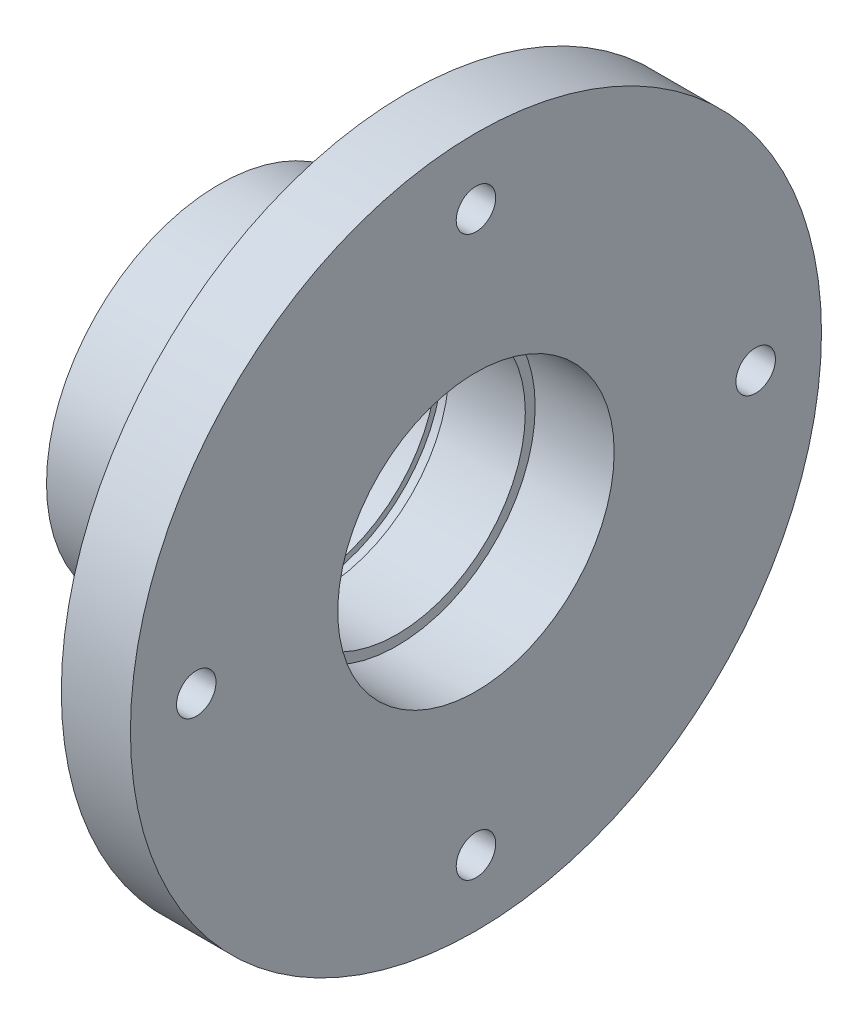
ISO-10303-21;
HEADER;
FILE_DESCRIPTION(('STEP AP214'),'2;1');
FILE_NAME('part.step','',(''),(''),'','','');
FILE_SCHEMA(('AUTOMOTIVE_DESIGN { 1 0 10303 214 1 1 1 1 }'));
ENDSEC;
DATA;
#1=APPLICATION_CONTEXT('core data for automotive mechanical design processes');
#2=APPLICATION_PROTOCOL_DEFINITION('international standard','automotive_design',2000,#1);
#3=PRODUCT_CONTEXT('',#1,'mechanical');
#4=PRODUCT('Part','Part','',(#3));
#5=PRODUCT_RELATED_PRODUCT_CATEGORY('part','',(#4));
#6=PRODUCT_DEFINITION_FORMATION('','',#4);
#7=PRODUCT_DEFINITION_CONTEXT('part definition',#1,'design');
#8=PRODUCT_DEFINITION('design','',#6,#7);
#9=PRODUCT_DEFINITION_SHAPE('','',#8);
#10=(LENGTH_UNIT() NAMED_UNIT(*) SI_UNIT(.MILLI.,.METRE.));
#11=(NAMED_UNIT(*) PLANE_ANGLE_UNIT() SI_UNIT($,.RADIAN.));
#12=(NAMED_UNIT(*) SI_UNIT($,.STERADIAN.) SOLID_ANGLE_UNIT());
#13=UNCERTAINTY_MEASURE_WITH_UNIT(LENGTH_MEASURE(1.E-05),#10,'distance_accuracy_value','');
#14=(GEOMETRIC_REPRESENTATION_CONTEXT(3) GLOBAL_UNCERTAINTY_ASSIGNED_CONTEXT((#13)) GLOBAL_UNIT_ASSIGNED_CONTEXT((#10,
#11,#12)) REPRESENTATION_CONTEXT('',''));
#15=CARTESIAN_POINT('',(0.,0.,0.));
#16=DIRECTION('',(0.,0.,1.));
#17=DIRECTION('',(1.,0.,0.));
#18=AXIS2_PLACEMENT_3D('',#15,#16,#17);
#19=CARTESIAN_POINT('',(-22.,0.,0.));
#20=DIRECTION('',(1.,0.,0.));
#21=DIRECTION('',(0.,0.,-1.));
#22=AXIS2_PLACEMENT_3D('',#19,#20,#21);
#23=CYLINDRICAL_SURFACE('',#22,13.);
#24=CARTESIAN_POINT('',(-22.,0.,0.));
#25=DIRECTION('',(1.,0.,0.));
#26=DIRECTION('',(0.,0.,-1.));
#27=AXIS2_PLACEMENT_3D('',#24,#25,#26);
#28=CIRCLE('',#27,13.);
#29=CARTESIAN_POINT('',(-22.,0.,-13.));
#30=VERTEX_POINT('',#29);
#31=EDGE_CURVE('E65',#30,#30,#28,.T.);
#32=ORIENTED_EDGE('',*,*,#31,.F.);
#33=EDGE_LOOP('',(#32));
#34=FACE_BOUND('',#33,.T.);
#35=CARTESIAN_POINT('',(-16.975,0.,0.));
#36=DIRECTION('',(1.,0.,0.));
#37=DIRECTION('',(0.,0.,-1.));
#38=AXIS2_PLACEMENT_3D('',#35,#36,#37);
#39=CIRCLE('',#38,13.);
#40=CARTESIAN_POINT('',(-16.975,0.,-13.));
#41=VERTEX_POINT('',#40);
#42=EDGE_CURVE('E34',#41,#41,#39,.F.);
#43=ORIENTED_EDGE('',*,*,#42,.F.);
#44=EDGE_LOOP('',(#43));
#45=FACE_BOUND('',#44,.T.);
#46=ADVANCED_FACE('F30',(#34,#45),#23,.F.);
#47=CARTESIAN_POINT('',(-15.725,0.,0.));
#48=DIRECTION('',(1.,0.,0.));
#49=DIRECTION('',(0.,0.,-1.));
#50=AXIS2_PLACEMENT_3D('',#47,#48,#49);
#51=CIRCLE('',#50,13.);
#52=CARTESIAN_POINT('',(-15.725,0.,-13.));
#53=VERTEX_POINT('',#52);
#54=EDGE_CURVE('E70',#53,#53,#51,.F.);
#55=ORIENTED_EDGE('',*,*,#54,.T.);
#56=EDGE_LOOP('',(#55));
#57=FACE_BOUND('',#56,.T.);
#58=CARTESIAN_POINT('',(-11.,12.7573508221731,2.5));
#59=CARTESIAN_POINT('',(-11.1390258597614,12.7573535445971,2.49999473771111));
#60=CARTESIAN_POINT('',(-11.2781192301831,12.759648106677,2.48836372459743));
#61=CARTESIAN_POINT('',(-11.5523790588853,12.7685662321878,2.44218113719486));
#62=CARTESIAN_POINT('',(-11.6875421600585,12.7751933891363,2.40761053611891));
#63=CARTESIAN_POINT('',(-11.9499336447423,12.7919990068767,2.31665374663639));
#64=CARTESIAN_POINT('',(-12.0771694738245,12.8021740742201,2.26028839852833));
#65=CARTESIAN_POINT('',(-12.3203725499391,12.8249250156472,2.12739803553043));
#66=CARTESIAN_POINT('',(-12.4363405806682,12.8375007225812,2.05087442406184));
#67=CARTESIAN_POINT('',(-12.6552412124363,12.8638197867113,1.87877245822431));
#68=CARTESIAN_POINT('',(-12.7580049495083,12.8775751102276,1.78298111863696));
#69=CARTESIAN_POINT('',(-12.9461075301476,12.90459798027,1.5755231225806));
#70=CARTESIAN_POINT('',(-13.0314452009445,12.9178654939172,1.46385539849171));
#71=CARTESIAN_POINT('',(-13.1829234102577,12.9425463769484,1.22670187107625));
#72=CARTESIAN_POINT('',(-13.248904258705,12.9539439985905,1.10111228887017));
#73=CARTESIAN_POINT('',(-13.3587664253272,12.9734667695503,0.840374478610753));
#74=CARTESIAN_POINT('',(-13.4026496551198,12.9815922019259,0.705227078537796));
#75=CARTESIAN_POINT('',(-13.4665474035056,12.9935705508999,0.430960845173449));
#76=CARTESIAN_POINT('',(-13.4868467751201,12.9974744160998,0.291910638125103));
#77=CARTESIAN_POINT('',(-13.5038885832221,13.0007455117712,0.0123270709409626));
#78=CARTESIAN_POINT('',(-13.500633125336,13.000113147748,-0.128206155502509));
#79=CARTESIAN_POINT('',(-13.4708752373941,12.9944227232998,-0.404811580289859));
#80=CARTESIAN_POINT('',(-13.4446795668691,12.9894230651197,-0.540918156089658));
#81=CARTESIAN_POINT('',(-13.3702705456875,12.9756254537905,-0.806767049653698));
#82=CARTESIAN_POINT('',(-13.3220563622883,12.9668273569848,-0.936509126506344));
#83=CARTESIAN_POINT('',(-13.2046897178559,12.9463243258099,-1.18683036724386));
#84=CARTESIAN_POINT('',(-13.135415554715,12.9346025687447,-1.30735103519341));
#85=CARTESIAN_POINT('',(-12.9779852060605,12.9095469786329,-1.53517146817959));
#86=CARTESIAN_POINT('',(-12.8898270046743,12.8962129735448,-1.64246981980512));
#87=CARTESIAN_POINT('',(-12.6954434908314,12.8691545349335,-1.84261846944045));
#88=CARTESIAN_POINT('',(-12.588949765765,12.855427272809,-1.93520788986346));
#89=CARTESIAN_POINT('',(-12.3618098253276,12.8293343997587,-2.10125316353158));
#90=CARTESIAN_POINT('',(-12.2411633810472,12.8169688108631,-2.17470870723888));
#91=CARTESIAN_POINT('',(-11.9887859827288,12.7949946866484,-2.30048133251873));
#92=CARTESIAN_POINT('',(-11.8570348448764,12.785391318016,-2.35275887460557));
#93=CARTESIAN_POINT('',(-11.5863924456211,12.7701067672006,-2.43436110074129));
#94=CARTESIAN_POINT('',(-11.4475020409036,12.7644251156011,-2.4636885318979));
#95=CARTESIAN_POINT('',(-11.1688806753715,12.7577206137951,-2.49817375220936));
#96=CARTESIAN_POINT('',(-11.0291978863162,12.7566253860666,-2.50370706985663));
#97=CARTESIAN_POINT('',(-10.7509046361303,12.759023830842,-2.49145509963841));
#98=CARTESIAN_POINT('',(-10.6122941194314,12.7625172639236,-2.4736710284025));
#99=CARTESIAN_POINT('',(-10.3413250568075,12.7736318530023,-2.41561200598846));
#100=CARTESIAN_POINT('',(-10.2089223958334,12.7812165991315,-2.37553534674613));
#101=CARTESIAN_POINT('',(-9.95271115254549,12.7996276252393,-2.27423978654129));
#102=CARTESIAN_POINT('',(-9.82890323296415,12.8104541548475,-2.21301925736502));
#103=CARTESIAN_POINT('',(-9.59174575761499,12.8342928537119,-2.07031485911768));
#104=CARTESIAN_POINT('',(-9.47854098556228,12.8473298999345,-1.98859461228271));
#105=CARTESIAN_POINT('',(-9.26731488113404,12.8740513624295,-1.80752787788233));
#106=CARTESIAN_POINT('',(-9.16929498985282,12.8877358399847,-1.70817971928818));
#107=CARTESIAN_POINT('',(-8.98981024796654,12.9144437282901,-1.49299681253014));
#108=CARTESIAN_POINT('',(-8.90859846794263,12.9274550888692,-1.37694924353664));
#109=CARTESIAN_POINT('',(-8.76682469390508,12.951145430407,-1.13263940226607));
#110=CARTESIAN_POINT('',(-8.70626187660335,12.9618245043496,-1.00437761723896));
#111=CARTESIAN_POINT('',(-8.60788027016444,12.9795953468859,-0.739966613700504));
#112=CARTESIAN_POINT('',(-8.56993918935383,12.9867063704086,-0.603864248412594));
#113=CARTESIAN_POINT('',(-8.5174888053798,12.9966222021743,-0.327068775042134));
#114=CARTESIAN_POINT('',(-8.50297690260318,12.9994274881639,-0.186376178041926));
#115=CARTESIAN_POINT('',(-8.49789116850745,13.0004055871504,0.0931827521181667));
#116=CARTESIAN_POINT('',(-8.5069357776698,12.9986522399737,0.232042028620335));
#117=CARTESIAN_POINT('',(-8.54786808016568,12.9908642019523,0.506222907249127));
#118=CARTESIAN_POINT('',(-8.5797555295344,12.9848295568325,0.641544547142218));
#119=CARTESIAN_POINT('',(-8.66530419238812,12.9691577474469,0.9045935492543));
#120=CARTESIAN_POINT('',(-8.71892280835151,12.9595276339264,1.03233521137864));
#121=CARTESIAN_POINT('',(-8.84636511450712,12.9377052532993,1.27706488245869));
#122=CARTESIAN_POINT('',(-8.92019025157382,12.9255128027329,1.39405212054941));
#123=CARTESIAN_POINT('',(-9.08725345032979,12.8996784805017,1.61584795767645));
#124=CARTESIAN_POINT('',(-9.18076617207764,12.8860176059801,1.72044748489624));
#125=CARTESIAN_POINT('',(-9.38398218256116,12.8589033276349,1.91260166612257));
#126=CARTESIAN_POINT('',(-9.4936892826799,12.8454499734772,2.00015229635294));
#127=CARTESIAN_POINT('',(-9.72746983895478,12.8201292259648,2.15653452422156));
#128=CARTESIAN_POINT('',(-9.85167375891601,12.8082786988589,2.22517391596926));
#129=CARTESIAN_POINT('',(-10.1100407737514,12.7877094152025,2.340501544276));
#130=CARTESIAN_POINT('',(-10.2441944703403,12.7789877475578,2.3872101977801));
#131=CARTESIAN_POINT('',(-10.4822583747453,12.7674530961672,2.4480213622143));
#132=CARTESIAN_POINT('',(-10.5847879876044,12.7636876084207,2.46747939479382));
#133=CARTESIAN_POINT('',(-10.7915324463374,12.7586354876446,2.49347049397996));
#134=CARTESIAN_POINT('',(-10.8957472418541,12.7573487806808,2.50000394608695));
#135=CARTESIAN_POINT('',(-11.,12.7573508221731,2.5));
#136=B_SPLINE_CURVE_WITH_KNOTS('',3,(#58,#59,#60,#61,#62,#63,#64,#65,#66,#67,#68,#69,#70,#71,
#72,#73,#74,#75,#76,#77,#78,#79,#80,#81,#82,#83,#84,#85,#86,#87,#88,#89,#90,#91,#92,#93,#94,#95,
#96,#97,#98,#99,#100,#101,#102,#103,#104,#105,#106,#107,#108,#109,#110,#111,#112,#113,#114,#115,
#116,#117,#118,#119,#120,#121,#122,#123,#124,#125,#126,#127,#128,#129,#130,#131,#132,#133,#134,
#135),.UNSPECIFIED.,.T.,.F.,(4,2,2,2,2,2,2,2,2,2,2,2,2,2,2,2,2,2,2,2,2,2,2,2,2,2,2,2,2,2,2,2,2,
2,2,2,2,2,4),(0.,0.416695988880008,0.833738030737637,1.25038227614466,1.66699752238094,
2.08849971831381,2.5100302719089,2.93494642182602,3.35982580683554,3.77951819081206,
4.19917305788035,4.61330049028081,5.02744358632398,5.44402696725573,5.8606548406758,
6.28400091938148,6.70735384633274,7.13149357344847,7.55558252364952,7.97295317898353,
8.39030205806814,8.8039966609312,9.21772312804067,9.63645909210582,10.0552347712562,
10.4799185943274,10.9045854829869,11.32693532976,11.7492383109661,12.1647436860035,
12.5802446234502,12.9949350033565,13.4096550846627,13.8305978202814,14.251639784134,
14.6768151908599,15.1015939816585,15.4140754294552,15.7265475567531),.UNSPECIFIED.);
#137=CARTESIAN_POINT('',(-11.,12.7573508221731,2.5));
#138=VERTEX_POINT('',#137);
#139=EDGE_CURVE('E68',#138,#138,#136,.T.);
#140=ORIENTED_EDGE('',*,*,#139,.F.);
#141=EDGE_LOOP('',(#140));
#142=FACE_BOUND('',#141,.T.);
#143=CARTESIAN_POINT('',(-8.,0.,0.));
#144=DIRECTION('',(1.,0.,0.));
#145=DIRECTION('',(0.,0.,-1.));
#146=AXIS2_PLACEMENT_3D('',#143,#144,#145);
#147=CIRCLE('',#146,13.);
#148=CARTESIAN_POINT('',(-8.,0.,-13.));
#149=VERTEX_POINT('',#148);
#150=EDGE_CURVE('E66',#149,#149,#147,.F.);
#151=ORIENTED_EDGE('',*,*,#150,.F.);
#152=EDGE_LOOP('',(#151));
#153=FACE_BOUND('',#152,.T.);
#154=ADVANCED_FACE('F128',(#57,#142,#153),#23,.F.);
#155=CARTESIAN_POINT('',(0.001000000000001,0.,0.));
#156=DIRECTION('',(-1.,0.,0.));
#157=DIRECTION('',(0.,0.,1.));
#158=AXIS2_PLACEMENT_3D('',#155,#156,#157);
#159=CYLINDRICAL_SURFACE('',#158,9.5);
#160=CARTESIAN_POINT('',(-26.,0.,0.));
#161=DIRECTION('',(-1.,0.,0.));
#162=DIRECTION('',(0.,0.,1.));
#163=AXIS2_PLACEMENT_3D('',#160,#161,#162);
#164=CIRCLE('',#163,9.5);
#165=CARTESIAN_POINT('',(-26.,0.,9.5));
#166=VERTEX_POINT('',#165);
#167=EDGE_CURVE('E64',#166,#166,#164,.T.);
#168=ORIENTED_EDGE('',*,*,#167,.T.);
#169=EDGE_LOOP('',(#168));
#170=FACE_BOUND('',#169,.T.);
#171=CARTESIAN_POINT('',(-22.,0.,0.));
#172=DIRECTION('',(1.,0.,0.));
#173=DIRECTION('',(0.,0.,-1.));
#174=AXIS2_PLACEMENT_3D('',#171,#172,#173);
#175=CIRCLE('',#174,9.5);
#176=CARTESIAN_POINT('',(-22.,0.,-9.5));
#177=VERTEX_POINT('',#176);
#178=EDGE_CURVE('E61',#177,#177,#175,.F.);
#179=ORIENTED_EDGE('',*,*,#178,.F.);
#180=EDGE_LOOP('',(#179));
#181=FACE_BOUND('',#180,.T.);
#182=ADVANCED_FACE('F134',(#170,#181),#159,.F.);
#183=CARTESIAN_POINT('',(11.,-8.05187028163345E-13,-28.3299999999992));
#184=DIRECTION('',(-1.,0.,0.));
#185=DIRECTION('',(0.,0.,1.));
#186=AXIS2_PLACEMENT_3D('',#183,#184,#185);
#187=CYLINDRICAL_SURFACE('',#186,2.00000000000129);
#188=CARTESIAN_POINT('',(0.,-8.05187028163345E-13,-28.3299999999992));
#189=DIRECTION('',(1.,0.,0.));
#190=DIRECTION('',(0.,0.,-1.));
#191=AXIS2_PLACEMENT_3D('',#188,#189,#190);
#192=CIRCLE('',#191,2.00000000000129);
#193=CARTESIAN_POINT('',(0.,-8.05187028163345E-13,-30.3300000000005));
#194=VERTEX_POINT('',#193);
#195=EDGE_CURVE('E60',#194,#194,#192,.T.);
#196=ORIENTED_EDGE('',*,*,#195,.T.);
#197=EDGE_LOOP('',(#196));
#198=FACE_BOUND('',#197,.T.);
#199=CARTESIAN_POINT('',(-4.,-8.05187028163345E-13,-28.3299999999992));
#200=DIRECTION('',(-1.,0.,0.));
#201=DIRECTION('',(0.,0.,1.));
#202=AXIS2_PLACEMENT_3D('',#199,#200,#201);
#203=CIRCLE('',#202,2.00000000000129);
#204=CARTESIAN_POINT('',(-4.,-8.05187028163345E-13,-26.3299999999979));
#205=VERTEX_POINT('',#204);
#206=EDGE_CURVE('E57',#205,#205,#203,.F.);
#207=ORIENTED_EDGE('',*,*,#206,.F.);
#208=EDGE_LOOP('',(#207));
#209=FACE_BOUND('',#208,.T.);
#210=ADVANCED_FACE('F142',(#198,#209),#187,.F.);
#211=CARTESIAN_POINT('',(11.,-28.33,1.60343520756272E-12));
#212=DIRECTION('',(-1.,0.,0.));
#213=DIRECTION('',(0.,0.,1.));
#214=AXIS2_PLACEMENT_3D('',#211,#212,#213);
#215=CYLINDRICAL_SURFACE('',#214,2.00000000000172);
#216=CARTESIAN_POINT('',(0.,-28.33,1.60343520756272E-12));
#217=DIRECTION('',(1.,0.,0.));
#218=DIRECTION('',(0.,0.,-1.));
#219=AXIS2_PLACEMENT_3D('',#216,#217,#218);
#220=CIRCLE('',#219,2.00000000000172);
#221=CARTESIAN_POINT('',(0.,-28.33,-2.00000000000012));
#222=VERTEX_POINT('',#221);
#223=EDGE_CURVE('E222',#222,#222,#220,.T.);
#224=ORIENTED_EDGE('',*,*,#223,.T.);
#225=EDGE_LOOP('',(#224));
#226=FACE_BOUND('',#225,.T.);
#227=CARTESIAN_POINT('',(-4.,-28.33,1.60343520756272E-12));
#228=DIRECTION('',(-1.,0.,0.));
#229=DIRECTION('',(0.,0.,1.));
#230=AXIS2_PLACEMENT_3D('',#227,#228,#229);
#231=CIRCLE('',#230,2.00000000000172);
#232=CARTESIAN_POINT('',(-4.,-28.33,2.00000000000333));
#233=VERTEX_POINT('',#232);
#234=EDGE_CURVE('E54',#233,#233,#231,.F.);
#235=ORIENTED_EDGE('',*,*,#234,.F.);
#236=EDGE_LOOP('',(#235));
#237=FACE_BOUND('',#236,.T.);
#238=ADVANCED_FACE('F184',(#226,#237),#215,.F.);
#239=CARTESIAN_POINT('',(11.,8.01717603781361E-13,28.3300000000008));
#240=DIRECTION('',(-1.,0.,0.));
#241=DIRECTION('',(0.,0.,1.));
#242=AXIS2_PLACEMENT_3D('',#239,#240,#241);
#243=CYLINDRICAL_SURFACE('',#242,2.00000000000063);
#244=CARTESIAN_POINT('',(0.,8.01717603781361E-13,28.3300000000008));
#245=DIRECTION('',(1.,0.,0.));
#246=DIRECTION('',(0.,0.,-1.));
#247=AXIS2_PLACEMENT_3D('',#244,#245,#246);
#248=CIRCLE('',#247,2.00000000000063);
#249=CARTESIAN_POINT('',(0.,8.01717603781361E-13,26.3300000000002));
#250=VERTEX_POINT('',#249);
#251=EDGE_CURVE('E218',#250,#250,#248,.T.);
#252=ORIENTED_EDGE('',*,*,#251,.T.);
#253=EDGE_LOOP('',(#252));
#254=FACE_BOUND('',#253,.T.);
#255=CARTESIAN_POINT('',(-4.,8.01717603781361E-13,28.3300000000008));
#256=DIRECTION('',(-1.,0.,0.));
#257=DIRECTION('',(0.,0.,1.));
#258=AXIS2_PLACEMENT_3D('',#255,#256,#257);
#259=CIRCLE('',#258,2.00000000000063);
#260=CARTESIAN_POINT('',(-4.,8.01717603781361E-13,30.3300000000014));
#261=VERTEX_POINT('',#260);
#262=EDGE_CURVE('E50',#261,#261,#259,.F.);
#263=ORIENTED_EDGE('',*,*,#262,.F.);
#264=EDGE_LOOP('',(#263));
#265=FACE_BOUND('',#264,.T.);
#266=ADVANCED_FACE('F180',(#254,#265),#243,.F.);
#267=CARTESIAN_POINT('',(11.,28.33,0.));
#268=DIRECTION('',(-1.,0.,0.));
#269=DIRECTION('',(0.,0.,1.));
#270=AXIS2_PLACEMENT_3D('',#267,#268,#269);
#271=CYLINDRICAL_SURFACE('',#270,2.);
#272=CARTESIAN_POINT('',(0.,28.33,0.));
#273=DIRECTION('',(1.,0.,0.));
#274=DIRECTION('',(0.,0.,-1.));
#275=AXIS2_PLACEMENT_3D('',#272,#273,#274);
#276=CIRCLE('',#275,2.);
#277=CARTESIAN_POINT('',(0.,28.33,-2.));
#278=VERTEX_POINT('',#277);
#279=EDGE_CURVE('E214',#278,#278,#276,.T.);
#280=ORIENTED_EDGE('',*,*,#279,.T.);
#281=EDGE_LOOP('',(#280));
#282=FACE_BOUND('',#281,.T.);
#283=CARTESIAN_POINT('',(-4.,28.33,0.));
#284=DIRECTION('',(-1.,0.,0.));
#285=DIRECTION('',(0.,0.,1.));
#286=AXIS2_PLACEMENT_3D('',#283,#284,#285);
#287=CIRCLE('',#286,2.);
#288=CARTESIAN_POINT('',(-4.,28.33,2.));
#289=VERTEX_POINT('',#288);
#290=EDGE_CURVE('E47',#289,#289,#287,.F.);
#291=ORIENTED_EDGE('',*,*,#290,.F.);
#292=EDGE_LOOP('',(#291));
#293=FACE_BOUND('',#292,.T.);
#294=ADVANCED_FACE('F177',(#282,#293),#271,.F.);
#295=CARTESIAN_POINT('',(-26.,0.,0.));
#296=DIRECTION('',(1.,0.,0.));
#297=DIRECTION('',(0.,0.,-1.));
#298=AXIS2_PLACEMENT_3D('',#295,#296,#297);
#299=CYLINDRICAL_SURFACE('',#298,35.);
#300=CARTESIAN_POINT('',(0.,0.,0.));
#301=DIRECTION('',(1.,0.,0.));
#302=DIRECTION('',(0.,0.,-1.));
#303=AXIS2_PLACEMENT_3D('',#300,#301,#302);
#304=CIRCLE('',#303,35.);
#305=CARTESIAN_POINT('',(0.,0.,-35.));
#306=VERTEX_POINT('',#305);
#307=EDGE_CURVE('E10',#306,#306,#304,.T.);
#308=ORIENTED_EDGE('',*,*,#307,.F.);
#309=EDGE_LOOP('',(#308));
#310=FACE_BOUND('',#309,.T.);
#311=CARTESIAN_POINT('',(-7.,0.,0.));
#312=DIRECTION('',(-1.,0.,0.));
#313=DIRECTION('',(0.,0.,1.));
#314=AXIS2_PLACEMENT_3D('',#311,#312,#313);
#315=CIRCLE('',#314,35.);
#316=CARTESIAN_POINT('',(-7.,0.,35.));
#317=VERTEX_POINT('',#316);
#318=EDGE_CURVE('E38',#317,#317,#315,.T.);
#319=ORIENTED_EDGE('',*,*,#318,.F.);
#320=EDGE_LOOP('',(#319));
#321=FACE_BOUND('',#320,.T.);
#322=ADVANCED_FACE('F32',(#310,#321),#299,.T.);
#323=CARTESIAN_POINT('',(0.,0.,0.));
#324=DIRECTION('',(1.,0.,0.));
#325=DIRECTION('',(0.,0.,-1.));
#326=AXIS2_PLACEMENT_3D('',#323,#324,#325);
#327=PLANE('',#326);
#328=CARTESIAN_POINT('',(0.,0.,0.));
#329=DIRECTION('',(1.,0.,0.));
#330=DIRECTION('',(0.,0.,-1.));
#331=AXIS2_PLACEMENT_3D('',#328,#329,#330);
#332=CIRCLE('',#331,14.);
#333=CARTESIAN_POINT('',(0.,0.,-14.));
#334=VERTEX_POINT('',#333);
#335=EDGE_CURVE('E76',#334,#334,#332,.T.);
#336=ORIENTED_EDGE('',*,*,#335,.F.);
#337=EDGE_LOOP('',(#336));
#338=FACE_BOUND('',#337,.T.);
#339=ORIENTED_EDGE('',*,*,#279,.F.);
#340=EDGE_LOOP('',(#339));
#341=FACE_BOUND('',#340,.T.);
#342=ORIENTED_EDGE('',*,*,#251,.F.);
#343=EDGE_LOOP('',(#342));
#344=FACE_BOUND('',#343,.T.);
#345=ORIENTED_EDGE('',*,*,#223,.F.);
#346=EDGE_LOOP('',(#345));
#347=FACE_BOUND('',#346,.T.);
#348=ORIENTED_EDGE('',*,*,#195,.F.);
#349=EDGE_LOOP('',(#348));
#350=FACE_BOUND('',#349,.T.);
#351=ORIENTED_EDGE('',*,*,#307,.T.);
#352=EDGE_LOOP('',(#351));
#353=FACE_BOUND('',#352,.T.);
#354=ADVANCED_FACE('F199',(#338,#341,#344,#347,#350,#353),#327,.T.);
#355=CARTESIAN_POINT('',(-7.,0.,0.));
#356=DIRECTION('',(-1.,0.,0.));
#357=DIRECTION('',(0.,0.,1.));
#358=AXIS2_PLACEMENT_3D('',#355,#356,#357);
#359=PLANE('',#358);
#360=CARTESIAN_POINT('',(-7.,28.33,0.));
#361=DIRECTION('',(-1.,0.,0.));
#362=DIRECTION('',(0.,0.,1.));
#363=AXIS2_PLACEMENT_3D('',#360,#361,#362);
#364=CIRCLE('',#363,5.5);
#365=CARTESIAN_POINT('',(-7.,28.33,5.5));
#366=VERTEX_POINT('',#365);
#367=EDGE_CURVE('E267',#366,#366,#364,.T.);
#368=ORIENTED_EDGE('',*,*,#367,.F.);
#369=EDGE_LOOP('',(#368));
#370=FACE_BOUND('',#369,.T.);
#371=CARTESIAN_POINT('',(-7.,8.01717603781361E-13,28.3300000000008));
#372=DIRECTION('',(-1.,0.,0.));
#373=DIRECTION('',(0.,0.,1.));
#374=AXIS2_PLACEMENT_3D('',#371,#372,#373);
#375=CIRCLE('',#374,5.5);
#376=CARTESIAN_POINT('',(-7.,8.01717603781361E-13,33.8300000000008));
#377=VERTEX_POINT('',#376);
#378=EDGE_CURVE('E261',#377,#377,#375,.T.);
#379=ORIENTED_EDGE('',*,*,#378,.F.);
#380=EDGE_LOOP('',(#379));
#381=FACE_BOUND('',#380,.T.);
#382=CARTESIAN_POINT('',(-7.,-28.33,1.60343520756272E-12));
#383=DIRECTION('',(-1.,0.,0.));
#384=DIRECTION('',(0.,0.,1.));
#385=AXIS2_PLACEMENT_3D('',#382,#383,#384);
#386=CIRCLE('',#385,5.5);
#387=CARTESIAN_POINT('',(-7.,-28.33,5.5000000000016));
#388=VERTEX_POINT('',#387);
#389=EDGE_CURVE('E255',#388,#388,#386,.T.);
#390=ORIENTED_EDGE('',*,*,#389,.F.);
#391=EDGE_LOOP('',(#390));
#392=FACE_BOUND('',#391,.T.);
#393=CARTESIAN_POINT('',(-7.,-8.05187028163345E-13,-28.3299999999992));
#394=DIRECTION('',(-1.,0.,0.));
#395=DIRECTION('',(0.,0.,1.));
#396=AXIS2_PLACEMENT_3D('',#393,#394,#395);
#397=CIRCLE('',#396,5.5);
#398=CARTESIAN_POINT('',(-7.,-8.05187028163345E-13,-22.8299999999992));
#399=VERTEX_POINT('',#398);
#400=EDGE_CURVE('E228',#399,#399,#397,.T.);
#401=ORIENTED_EDGE('',*,*,#400,.F.);
#402=EDGE_LOOP('',(#401));
#403=FACE_BOUND('',#402,.T.);
#404=CARTESIAN_POINT('',(-7.,0.,0.));
#405=DIRECTION('',(-1.,0.,0.));
#406=DIRECTION('',(0.,0.,1.));
#407=AXIS2_PLACEMENT_3D('',#404,#405,#406);
#408=CIRCLE('',#407,17.5);
#409=CARTESIAN_POINT('',(-7.,0.,17.5));
#410=VERTEX_POINT('',#409);
#411=EDGE_CURVE('E43',#410,#410,#408,.T.);
#412=ORIENTED_EDGE('',*,*,#411,.F.);
#413=EDGE_LOOP('',(#412));
#414=FACE_BOUND('',#413,.T.);
#415=ORIENTED_EDGE('',*,*,#318,.T.);
#416=EDGE_LOOP('',(#415));
#417=FACE_BOUND('',#416,.T.);
#418=ADVANCED_FACE('F195',(#370,#381,#392,#403,#414,#417),#359,.T.);
#419=CARTESIAN_POINT('',(-7.,0.,0.));
#420=DIRECTION('',(-1.,0.,0.));
#421=DIRECTION('',(0.,0.,1.));
#422=AXIS2_PLACEMENT_3D('',#419,#420,#421);
#423=CYLINDRICAL_SURFACE('',#422,17.5);
#424=CARTESIAN_POINT('',(-11.,17.3205080756888,2.5));
#425=CARTESIAN_POINT('',(-11.1396552140505,17.3205103214296,2.4999941764498));
#426=CARTESIAN_POINT('',(-11.2793933909654,17.3222153996634,2.488258306336));
#427=CARTESIAN_POINT('',(-11.5549682955289,17.3288474891277,2.44163425172347));
#428=CARTESIAN_POINT('',(-11.6908009943939,17.3337777110364,2.40672299527128));
#429=CARTESIAN_POINT('',(-11.9545358750361,17.346290533042,2.31480923545587));
#430=CARTESIAN_POINT('',(-12.0824438476257,17.3538711688453,2.257823089026));
#431=CARTESIAN_POINT('',(-12.3268621618351,17.3708283324759,2.12341469861513));
#432=CARTESIAN_POINT('',(-12.4433741838004,17.3802045949313,2.04599547375906));
#433=CARTESIAN_POINT('',(-12.6625603698092,17.3997728156945,1.87231683550246));
#434=CARTESIAN_POINT('',(-12.7651396423324,17.4099696809092,1.77593820534162));
#435=CARTESIAN_POINT('',(-12.9527269465507,17.4299862889805,1.56733384870893));
#436=CARTESIAN_POINT('',(-13.0377340408003,17.4398060116946,1.45510727731391));
#437=CARTESIAN_POINT('',(-13.1881113721996,17.4580129627861,1.21738798002561));
#438=CARTESIAN_POINT('',(-13.253394643148,17.4663937786684,1.09183970777011));
#439=CARTESIAN_POINT('',(-13.3619134191598,17.4807243931613,0.83142093245387));
#440=CARTESIAN_POINT('',(-13.4051499833092,17.4866743085456,0.696550877549161));
#441=CARTESIAN_POINT('',(-13.4680615087053,17.4954381251123,0.422292579426188));
#442=CARTESIAN_POINT('',(-13.4878950874578,17.4982731289764,0.282941406337347));
#443=CARTESIAN_POINT('',(-13.5039298732082,17.5005599435479,0.00286195659799789));
#444=CARTESIAN_POINT('',(-13.5001322774576,17.5000119256529,-0.137866249925725));
#445=CARTESIAN_POINT('',(-13.4691382772302,17.4956113682908,-0.415623740232339));
#446=CARTESIAN_POINT('',(-13.4421125013969,17.4917829266554,-0.552672499713795));
#447=CARTESIAN_POINT('',(-13.365696800376,17.4812785676579,-0.820269493910869));
#448=CARTESIAN_POINT('',(-13.3163063437653,17.4746025826336,-0.950817574077355));
#449=CARTESIAN_POINT('',(-13.1963865690205,17.4591117546373,-1.20222745845967));
#450=CARTESIAN_POINT('',(-13.1257848111015,17.4502896021464,-1.32305424098884));
#451=CARTESIAN_POINT('',(-12.9654993840747,17.4314908337029,-1.55120977517206));
#452=CARTESIAN_POINT('',(-12.875814574196,17.4215141487494,-1.65853771926479));
#453=CARTESIAN_POINT('',(-12.678956747905,17.4014150617975,-1.85765373882983));
#454=CARTESIAN_POINT('',(-12.5716348340635,17.3912921538904,-1.9492946166523));
#455=CARTESIAN_POINT('',(-12.3430568482131,17.3721286734458,-2.11328736987654));
#456=CARTESIAN_POINT('',(-12.221800704818,17.3630881064538,-2.18563914645223));
#457=CARTESIAN_POINT('',(-11.9686496376173,17.3471131710366,-2.30901626900994));
#458=CARTESIAN_POINT('',(-11.8367477426467,17.3401801971233,-2.36002750314723));
#459=CARTESIAN_POINT('',(-11.5661280252176,17.3292308226119,-2.439132796354));
#460=CARTESIAN_POINT('',(-11.4274106370105,17.3252142364516,-2.46722831350378));
#461=CARTESIAN_POINT('',(-11.1484043282124,17.3205872594665,-2.49950488360242));
#462=CARTESIAN_POINT('',(-11.0081399675055,17.3199472150388,-2.5038941388059));
#463=CARTESIAN_POINT('',(-10.7288777437186,17.3220671566589,-2.48918510308901));
#464=CARTESIAN_POINT('',(-10.5898798452209,17.3248270473289,-2.47008747104213));
#465=CARTESIAN_POINT('',(-10.3177347749644,17.3334087065645,-2.40912297319002));
#466=CARTESIAN_POINT('',(-10.1845640911683,17.3392166418156,-2.36735894805526));
#467=CARTESIAN_POINT('',(-9.92711400317938,17.3532286401521,-2.26235382714329));
#468=CARTESIAN_POINT('',(-9.80283500054784,17.3614328113701,-2.19911176212676));
#469=CARTESIAN_POINT('',(-9.56576015034814,17.3793831051677,-2.05244200414032));
#470=CARTESIAN_POINT('',(-9.45304879848455,17.3891394056538,-1.96887900033906));
#471=CARTESIAN_POINT('',(-9.24317534546811,17.4090636358241,-1.78412847276706));
#472=CARTESIAN_POINT('',(-9.14601403992609,17.4192315865368,-1.6829400477527));
#473=CARTESIAN_POINT('',(-8.96925597695775,17.4389256551739,-1.46489635785669));
#474=CARTESIAN_POINT('',(-8.88979684710059,17.4484463695232,-1.34792896515541));
#475=CARTESIAN_POINT('',(-8.75165554608034,17.4656902694975,-1.10218588096399));
#476=CARTESIAN_POINT('',(-8.69297285032756,17.4734135005061,-0.973410487720566));
#477=CARTESIAN_POINT('',(-8.59827235710535,17.4861684730555,-0.708144905742413));
#478=CARTESIAN_POINT('',(-8.56217801421564,17.4912092957152,-0.571682498904909));
#479=CARTESIAN_POINT('',(-8.51343066611674,17.4980694889566,-0.294556573807229));
#480=CARTESIAN_POINT('',(-8.50077626268269,17.4998890516906,-0.153893306642843));
#481=CARTESIAN_POINT('',(-8.4992997013194,17.5001000958988,0.126303913283945));
#482=CARTESIAN_POINT('',(-8.51026647622693,17.4985219377795,0.26583677718822));
#483=CARTESIAN_POINT('',(-8.55527018755381,17.4921758034385,0.541053291849851));
#484=CARTESIAN_POINT('',(-8.58930706950492,17.4874078347479,0.676736951694342));
#485=CARTESIAN_POINT('',(-8.67941247178516,17.4752152756766,0.940354643121525));
#486=CARTESIAN_POINT('',(-8.73546772560562,17.4677922852398,1.06829328775859));
#487=CARTESIAN_POINT('',(-8.86799643650284,17.4511070012847,1.3129821323145));
#488=CARTESIAN_POINT('',(-8.94447043132376,17.4418446593271,1.42973203745873));
#489=CARTESIAN_POINT('',(-9.11643464402808,17.4224130932707,1.64980243700277));
#490=CARTESIAN_POINT('',(-9.21208113353637,17.4122368231533,1.75300020789777));
#491=CARTESIAN_POINT('',(-9.41934695029837,17.3921777929122,1.94195895909259));
#492=CARTESIAN_POINT('',(-9.53097002876153,17.3822951023791,2.02771583289178));
#493=CARTESIAN_POINT('',(-9.76768179790604,17.3638885978291,2.17974404343878));
#494=CARTESIAN_POINT('',(-9.89283586295939,17.3553719241531,2.24591442873638));
#495=CARTESIAN_POINT('',(-10.1525403707009,17.3407453505435,2.35619878131273));
#496=CARTESIAN_POINT('',(-10.2870807478824,17.3346329177213,2.40033597402073));
#497=CARTESIAN_POINT('',(-10.5185455322955,17.3269411528972,2.4551156895733));
#498=CARTESIAN_POINT('',(-10.6140304192652,17.3245412999151,2.47192203162013));
#499=CARTESIAN_POINT('',(-10.8063302462053,17.3213239914062,2.49436614385582));
#500=CARTESIAN_POINT('',(-10.903145171307,17.3205065182042,2.50000403879626));
#501=CARTESIAN_POINT('',(-11.,17.3205080756888,2.5));
#502=B_SPLINE_CURVE_WITH_KNOTS('',3,(#424,#425,#426,#427,#428,#429,#430,#431,#432,#433,#434,
#435,#436,#437,#438,#439,#440,#441,#442,#443,#444,#445,#446,#447,#448,#449,#450,#451,#452,#453,
#454,#455,#456,#457,#458,#459,#460,#461,#462,#463,#464,#465,#466,#467,#468,#469,#470,#471,#472,
#473,#474,#475,#476,#477,#478,#479,#480,#481,#482,#483,#484,#485,#486,#487,#488,#489,#490,#491,
#492,#493,#494,#495,#496,#497,#498,#499,#500,#501),.UNSPECIFIED.,.T.,.F.,(4,2,2,2,2,2,2,2,2,2,2,
2,2,2,2,2,2,2,2,2,2,2,2,2,2,2,2,2,2,2,2,2,2,2,2,2,2,2,4),(0.,0.418611686761216,
0.837640743157851,1.25635990174198,1.67501722635384,2.09639644561274,2.51779813893171,
2.94103163345004,3.36424479463775,3.78457277673272,4.20487946347624,4.62212481134302,
5.03938007419639,5.45807684551733,5.87679865326299,6.29925647482804,6.72171646077847,
7.14445536663838,7.56716737238594,7.986160763532,8.40514240099882,8.82223876005373,
9.23935394391406,9.65932651264329,10.0793205622075,10.5024740190271,10.9256167907707,
11.3473177767363,11.7689936068438,12.1869171913008,12.6048397890488,13.022510965389,
13.4401931425249,13.8614293663583,14.2827646567287,14.7062351939404,15.1292583986304,
15.4195806495844,15.7098996576198),.UNSPECIFIED.);
#503=CARTESIAN_POINT('',(-11.,17.3205080756888,2.5));
#504=VERTEX_POINT('',#503);
#505=EDGE_CURVE('E96',#504,#504,#502,.T.);
#506=ORIENTED_EDGE('',*,*,#505,.T.);
#507=EDGE_LOOP('',(#506));
#508=FACE_BOUND('',#507,.T.);
#509=ORIENTED_EDGE('',*,*,#411,.T.);
#510=EDGE_LOOP('',(#509));
#511=FACE_BOUND('',#510,.T.);
#512=CARTESIAN_POINT('',(-26.,0.,0.));
#513=DIRECTION('',(-1.,0.,0.));
#514=DIRECTION('',(0.,0.,1.));
#515=AXIS2_PLACEMENT_3D('',#512,#513,#514);
#516=CIRCLE('',#515,17.5);
#517=CARTESIAN_POINT('',(-26.,0.,17.5));
#518=VERTEX_POINT('',#517);
#519=EDGE_CURVE('E233',#518,#518,#516,.T.);
#520=ORIENTED_EDGE('',*,*,#519,.F.);
#521=EDGE_LOOP('',(#520));
#522=FACE_BOUND('',#521,.T.);
#523=ADVANCED_FACE('F192',(#508,#511,#522),#423,.T.);
#524=CARTESIAN_POINT('',(-26.,0.,0.));
#525=DIRECTION('',(1.,0.,0.));
#526=DIRECTION('',(0.,0.,-1.));
#527=AXIS2_PLACEMENT_3D('',#524,#525,#526);
#528=PLANE('',#527);
#529=ORIENTED_EDGE('',*,*,#167,.F.);
#530=EDGE_LOOP('',(#529));
#531=FACE_BOUND('',#530,.T.);
#532=ORIENTED_EDGE('',*,*,#519,.T.);
#533=EDGE_LOOP('',(#532));
#534=FACE_BOUND('',#533,.T.);
#535=ADVANCED_FACE('F148',(#531,#534),#528,.F.);
#536=CARTESIAN_POINT('',(-4.,28.33,0.));
#537=DIRECTION('',(-1.,0.,0.));
#538=DIRECTION('',(0.,0.,1.));
#539=AXIS2_PLACEMENT_3D('',#536,#537,#538);
#540=PLANE('',#539);
#541=CARTESIAN_POINT('',(-4.,28.33,0.));
#542=DIRECTION('',(-1.,0.,0.));
#543=DIRECTION('',(0.,0.,1.));
#544=AXIS2_PLACEMENT_3D('',#541,#542,#543);
#545=CIRCLE('',#544,5.5);
#546=CARTESIAN_POINT('',(-4.,28.33,5.5));
#547=VERTEX_POINT('',#546);
#548=EDGE_CURVE('E51',#547,#547,#545,.T.);
#549=ORIENTED_EDGE('',*,*,#548,.T.);
#550=EDGE_LOOP('',(#549));
#551=FACE_BOUND('',#550,.T.);
#552=ORIENTED_EDGE('',*,*,#290,.T.);
#553=EDGE_LOOP('',(#552));
#554=FACE_BOUND('',#553,.T.);
#555=ADVANCED_FACE('F144',(#551,#554),#540,.T.);
#556=CARTESIAN_POINT('',(-4.,28.33,0.));
#557=DIRECTION('',(-1.,0.,0.));
#558=DIRECTION('',(0.,0.,1.));
#559=AXIS2_PLACEMENT_3D('',#556,#557,#558);
#560=CYLINDRICAL_SURFACE('',#559,5.5);
#561=ORIENTED_EDGE('',*,*,#548,.F.);
#562=EDGE_LOOP('',(#561));
#563=FACE_BOUND('',#562,.T.);
#564=ORIENTED_EDGE('',*,*,#367,.T.);
#565=EDGE_LOOP('',(#564));
#566=FACE_BOUND('',#565,.T.);
#567=ADVANCED_FACE('F147',(#563,#566),#560,.F.);
#568=CARTESIAN_POINT('',(-4.,8.01717603781361E-13,28.3300000000008));
#569=DIRECTION('',(-1.,0.,0.));
#570=DIRECTION('',(0.,0.,1.));
#571=AXIS2_PLACEMENT_3D('',#568,#569,#570);
#572=PLANE('',#571);
#573=CARTESIAN_POINT('',(-4.,8.01717603781361E-13,28.3300000000008));
#574=DIRECTION('',(-1.,0.,0.));
#575=DIRECTION('',(0.,0.,1.));
#576=AXIS2_PLACEMENT_3D('',#573,#574,#575);
#577=CIRCLE('',#576,5.5);
#578=CARTESIAN_POINT('',(-4.,8.01717603781361E-13,33.8300000000008));
#579=VERTEX_POINT('',#578);
#580=EDGE_CURVE('E264',#579,#579,#577,.T.);
#581=ORIENTED_EDGE('',*,*,#580,.T.);
#582=EDGE_LOOP('',(#581));
#583=FACE_BOUND('',#582,.T.);
#584=ORIENTED_EDGE('',*,*,#262,.T.);
#585=EDGE_LOOP('',(#584));
#586=FACE_BOUND('',#585,.T.);
#587=ADVANCED_FACE('F152',(#583,#586),#572,.T.);
#588=CARTESIAN_POINT('',(-4.,8.01717603781361E-13,28.3300000000008));
#589=DIRECTION('',(-1.,0.,0.));
#590=DIRECTION('',(0.,0.,1.));
#591=AXIS2_PLACEMENT_3D('',#588,#589,#590);
#592=CYLINDRICAL_SURFACE('',#591,5.5);
#593=ORIENTED_EDGE('',*,*,#580,.F.);
#594=EDGE_LOOP('',(#593));
#595=FACE_BOUND('',#594,.T.);
#596=ORIENTED_EDGE('',*,*,#378,.T.);
#597=EDGE_LOOP('',(#596));
#598=FACE_BOUND('',#597,.T.);
#599=ADVANCED_FACE('F156',(#595,#598),#592,.F.);
#600=CARTESIAN_POINT('',(-4.,-28.33,1.60343520756272E-12));
#601=DIRECTION('',(-1.,0.,0.));
#602=DIRECTION('',(0.,0.,1.));
#603=AXIS2_PLACEMENT_3D('',#600,#601,#602);
#604=PLANE('',#603);
#605=CARTESIAN_POINT('',(-4.,-28.33,1.60343520756272E-12));
#606=DIRECTION('',(-1.,0.,0.));
#607=DIRECTION('',(0.,0.,1.));
#608=AXIS2_PLACEMENT_3D('',#605,#606,#607);
#609=CIRCLE('',#608,5.5);
#610=CARTESIAN_POINT('',(-4.,-28.33,5.5000000000016));
#611=VERTEX_POINT('',#610);
#612=EDGE_CURVE('E258',#611,#611,#609,.T.);
#613=ORIENTED_EDGE('',*,*,#612,.T.);
#614=EDGE_LOOP('',(#613));
#615=FACE_BOUND('',#614,.T.);
#616=ORIENTED_EDGE('',*,*,#234,.T.);
#617=EDGE_LOOP('',(#616));
#618=FACE_BOUND('',#617,.T.);
#619=ADVANCED_FACE('F160',(#615,#618),#604,.T.);
#620=CARTESIAN_POINT('',(-4.,-28.33,1.60343520756272E-12));
#621=DIRECTION('',(-1.,0.,0.));
#622=DIRECTION('',(0.,0.,1.));
#623=AXIS2_PLACEMENT_3D('',#620,#621,#622);
#624=CYLINDRICAL_SURFACE('',#623,5.5);
#625=ORIENTED_EDGE('',*,*,#612,.F.);
#626=EDGE_LOOP('',(#625));
#627=FACE_BOUND('',#626,.T.);
#628=ORIENTED_EDGE('',*,*,#389,.T.);
#629=EDGE_LOOP('',(#628));
#630=FACE_BOUND('',#629,.T.);
#631=ADVANCED_FACE('F164',(#627,#630),#624,.F.);
#632=CARTESIAN_POINT('',(-4.,-8.05187028163345E-13,-28.3299999999992));
#633=DIRECTION('',(-1.,0.,0.));
#634=DIRECTION('',(0.,0.,1.));
#635=AXIS2_PLACEMENT_3D('',#632,#633,#634);
#636=PLANE('',#635);
#637=CARTESIAN_POINT('',(-4.,-8.05187028163345E-13,-28.3299999999992));
#638=DIRECTION('',(-1.,0.,0.));
#639=DIRECTION('',(0.,0.,1.));
#640=AXIS2_PLACEMENT_3D('',#637,#638,#639);
#641=CIRCLE('',#640,5.5);
#642=CARTESIAN_POINT('',(-4.,-8.05187028163345E-13,-22.8299999999992));
#643=VERTEX_POINT('',#642);
#644=EDGE_CURVE('E252',#643,#643,#641,.T.);
#645=ORIENTED_EDGE('',*,*,#644,.T.);
#646=EDGE_LOOP('',(#645));
#647=FACE_BOUND('',#646,.T.);
#648=ORIENTED_EDGE('',*,*,#206,.T.);
#649=EDGE_LOOP('',(#648));
#650=FACE_BOUND('',#649,.T.);
#651=ADVANCED_FACE('F168',(#647,#650),#636,.T.);
#652=CARTESIAN_POINT('',(-4.,-8.05187028163345E-13,-28.3299999999992));
#653=DIRECTION('',(-1.,0.,0.));
#654=DIRECTION('',(0.,0.,1.));
#655=AXIS2_PLACEMENT_3D('',#652,#653,#654);
#656=CYLINDRICAL_SURFACE('',#655,5.5);
#657=ORIENTED_EDGE('',*,*,#644,.F.);
#658=EDGE_LOOP('',(#657));
#659=FACE_BOUND('',#658,.T.);
#660=ORIENTED_EDGE('',*,*,#400,.T.);
#661=EDGE_LOOP('',(#660));
#662=FACE_BOUND('',#661,.T.);
#663=ADVANCED_FACE('F172',(#659,#662),#656,.F.);
#664=CARTESIAN_POINT('',(-22.,0.,0.));
#665=DIRECTION('',(1.,0.,0.));
#666=DIRECTION('',(0.,0.,-1.));
#667=AXIS2_PLACEMENT_3D('',#664,#665,#666);
#668=PLANE('',#667);
#669=ORIENTED_EDGE('',*,*,#31,.T.);
#670=EDGE_LOOP('',(#669));
#671=FACE_BOUND('',#670,.T.);
#672=ORIENTED_EDGE('',*,*,#178,.T.);
#673=EDGE_LOOP('',(#672));
#674=FACE_BOUND('',#673,.T.);
#675=ADVANCED_FACE('F139',(#671,#674),#668,.T.);
#676=CARTESIAN_POINT('',(-11.,-35.001,0.));
#677=DIRECTION('',(0.,1.,0.));
#678=DIRECTION('',(0.,0.,1.));
#679=AXIS2_PLACEMENT_3D('',#676,#677,#678);
#680=CYLINDRICAL_SURFACE('',#679,2.5);
#681=ORIENTED_EDGE('',*,*,#505,.F.);
#682=EDGE_LOOP('',(#681));
#683=FACE_BOUND('',#682,.T.);
#684=ORIENTED_EDGE('',*,*,#139,.T.);
#685=EDGE_LOOP('',(#684));
#686=FACE_BOUND('',#685,.T.);
#687=ADVANCED_FACE('F102',(#683,#686),#680,.F.);
#688=CARTESIAN_POINT('',(-8.,0.,0.));
#689=DIRECTION('',(1.,0.,0.));
#690=DIRECTION('',(0.,0.,-1.));
#691=AXIS2_PLACEMENT_3D('',#688,#689,#690);
#692=PLANE('',#691);
#693=CARTESIAN_POINT('',(-8.,0.,0.));
#694=DIRECTION('',(1.,0.,0.));
#695=DIRECTION('',(0.,0.,-1.));
#696=AXIS2_PLACEMENT_3D('',#693,#694,#695);
#697=CIRCLE('',#696,14.);
#698=CARTESIAN_POINT('',(-8.,0.,-14.));
#699=VERTEX_POINT('',#698);
#700=EDGE_CURVE('E69',#699,#699,#697,.T.);
#701=ORIENTED_EDGE('',*,*,#700,.T.);
#702=EDGE_LOOP('',(#701));
#703=FACE_BOUND('',#702,.T.);
#704=ORIENTED_EDGE('',*,*,#150,.T.);
#705=EDGE_LOOP('',(#704));
#706=FACE_BOUND('',#705,.T.);
#707=ADVANCED_FACE('F110',(#703,#706),#692,.T.);
#708=CARTESIAN_POINT('',(-8.,0.,0.));
#709=DIRECTION('',(1.,0.,0.));
#710=DIRECTION('',(0.,0.,-1.));
#711=AXIS2_PLACEMENT_3D('',#708,#709,#710);
#712=CYLINDRICAL_SURFACE('',#711,14.);
#713=ORIENTED_EDGE('',*,*,#700,.F.);
#714=EDGE_LOOP('',(#713));
#715=FACE_BOUND('',#714,.T.);
#716=ORIENTED_EDGE('',*,*,#335,.T.);
#717=EDGE_LOOP('',(#716));
#718=FACE_BOUND('',#717,.T.);
#719=ADVANCED_FACE('F106',(#715,#718),#712,.F.);
#720=CARTESIAN_POINT('',(-16.975,0.,0.));
#721=DIRECTION('',(1.,0.,0.));
#722=DIRECTION('',(0.,0.,-1.));
#723=AXIS2_PLACEMENT_3D('',#720,#721,#722);
#724=PLANE('',#723);
#725=CARTESIAN_POINT('',(-16.975,0.,0.));
#726=DIRECTION('',(1.,0.,0.));
#727=DIRECTION('',(0.,0.,-1.));
#728=AXIS2_PLACEMENT_3D('',#725,#726,#727);
#729=CIRCLE('',#728,13.6);
#730=CARTESIAN_POINT('',(-16.975,0.,-13.6));
#731=VERTEX_POINT('',#730);
#732=EDGE_CURVE('E72',#731,#731,#729,.T.);
#733=ORIENTED_EDGE('',*,*,#732,.T.);
#734=EDGE_LOOP('',(#733));
#735=FACE_BOUND('',#734,.T.);
#736=ORIENTED_EDGE('',*,*,#42,.T.);
#737=EDGE_LOOP('',(#736));
#738=FACE_BOUND('',#737,.T.);
#739=ADVANCED_FACE('F109',(#735,#738),#724,.T.);
#740=CARTESIAN_POINT('',(-15.725,0.,0.));
#741=DIRECTION('',(1.,0.,0.));
#742=DIRECTION('',(0.,0.,-1.));
#743=AXIS2_PLACEMENT_3D('',#740,#741,#742);
#744=PLANE('',#743);
#745=CARTESIAN_POINT('',(-15.725,0.,0.));
#746=DIRECTION('',(1.,0.,0.));
#747=DIRECTION('',(0.,0.,-1.));
#748=AXIS2_PLACEMENT_3D('',#745,#746,#747);
#749=CIRCLE('',#748,13.6);
#750=CARTESIAN_POINT('',(-15.725,0.,-13.6));
#751=VERTEX_POINT('',#750);
#752=EDGE_CURVE('E78',#751,#751,#749,.T.);
#753=ORIENTED_EDGE('',*,*,#752,.F.);
#754=EDGE_LOOP('',(#753));
#755=FACE_BOUND('',#754,.T.);
#756=ORIENTED_EDGE('',*,*,#54,.F.);
#757=EDGE_LOOP('',(#756));
#758=FACE_BOUND('',#757,.T.);
#759=ADVANCED_FACE('F118',(#755,#758),#744,.F.);
#760=CARTESIAN_POINT('',(-16.975,0.,0.));
#761=DIRECTION('',(1.,0.,0.));
#762=DIRECTION('',(0.,0.,-1.));
#763=AXIS2_PLACEMENT_3D('',#760,#761,#762);
#764=CYLINDRICAL_SURFACE('',#763,13.6);
#765=ORIENTED_EDGE('',*,*,#732,.F.);
#766=EDGE_LOOP('',(#765));
#767=FACE_BOUND('',#766,.T.);
#768=ORIENTED_EDGE('',*,*,#752,.T.);
#769=EDGE_LOOP('',(#768));
#770=FACE_BOUND('',#769,.T.);
#771=ADVANCED_FACE('F115',(#767,#770),#764,.F.);
#772=CLOSED_SHELL('',(#46,#154,#182,#210,#238,#266,#294,#322,#354,#418,#523,#535,#555,#567,#587,
#599,#619,#631,#651,#663,#675,#687,#707,#719,#739,#759,#771));
#773=MANIFOLD_SOLID_BREP('B2',#772);
#774=ADVANCED_BREP_SHAPE_REPRESENTATION('',(#18,#773),#14);
#775=SHAPE_DEFINITION_REPRESENTATION(#9,#774);
ENDSEC;
END-ISO-10303-21;
